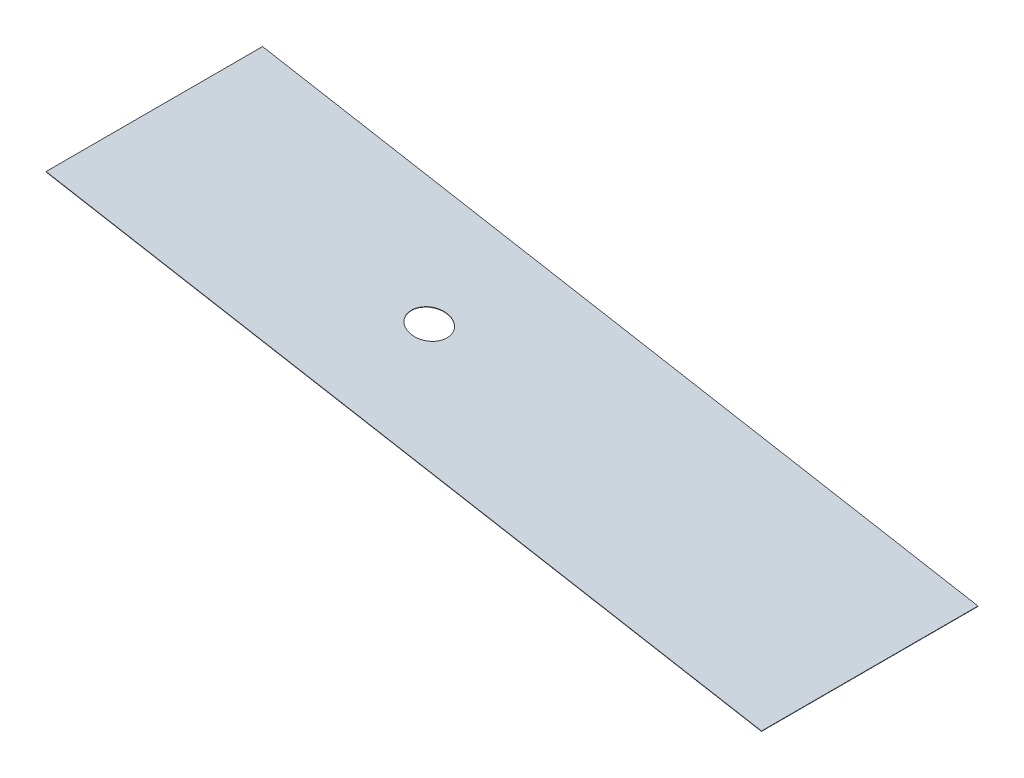
ISO-10303-21;
HEADER;
FILE_DESCRIPTION(('STEP AP214'),'2;1');
FILE_NAME('part.step','',(''),(''),'','','');
FILE_SCHEMA(('AUTOMOTIVE_DESIGN { 1 0 10303 214 1 1 1 1 }'));
ENDSEC;
DATA;
#1=APPLICATION_CONTEXT('core data for automotive mechanical design processes');
#2=APPLICATION_PROTOCOL_DEFINITION('international standard','automotive_design',2000,#1);
#3=PRODUCT_CONTEXT('',#1,'mechanical');
#4=PRODUCT('Part','Part','',(#3));
#5=PRODUCT_RELATED_PRODUCT_CATEGORY('part','',(#4));
#6=PRODUCT_DEFINITION_FORMATION('','',#4);
#7=PRODUCT_DEFINITION_CONTEXT('part definition',#1,'design');
#8=PRODUCT_DEFINITION('design','',#6,#7);
#9=PRODUCT_DEFINITION_SHAPE('','',#8);
#10=(LENGTH_UNIT() NAMED_UNIT(*) SI_UNIT(.MILLI.,.METRE.));
#11=(NAMED_UNIT(*) PLANE_ANGLE_UNIT() SI_UNIT($,.RADIAN.));
#12=(NAMED_UNIT(*) SI_UNIT($,.STERADIAN.) SOLID_ANGLE_UNIT());
#13=UNCERTAINTY_MEASURE_WITH_UNIT(LENGTH_MEASURE(1.E-05),#10,'distance_accuracy_value','');
#14=(GEOMETRIC_REPRESENTATION_CONTEXT(3) GLOBAL_UNCERTAINTY_ASSIGNED_CONTEXT((#13)) GLOBAL_UNIT_ASSIGNED_CONTEXT((#10,
#11,#12)) REPRESENTATION_CONTEXT('',''));
#15=CARTESIAN_POINT('',(0.,0.,0.));
#16=DIRECTION('',(0.,0.,1.));
#17=DIRECTION('',(1.,0.,0.));
#18=AXIS2_PLACEMENT_3D('',#15,#16,#17);
#19=CARTESIAN_POINT('',(139.867775939067,789.201656900097,1.21163856052703E-12));
#20=DIRECTION('',(0.984655841422455,-0.174507518326972,0.));
#21=DIRECTION('',(0.,0.,1.));
#22=AXIS2_PLACEMENT_3D('',#19,#20,#21);
#23=PLANE('',#22);
#24=DIRECTION('',(-0.174507518326972,-0.984655841422454,0.));
#25=VECTOR('',#24,1.);
#26=CARTESIAN_POINT('',(139.867775939067,789.201656900097,750.000000000002));
#27=LINE('',#26,#25);
#28=CARTESIAN_POINT('',(140.129537216556,790.678640662231,750.000000000002));
#29=VERTEX_POINT('',#28);
#30=CARTESIAN_POINT('',(139.606014661575,787.724673137964,750.000000000002));
#31=VERTEX_POINT('',#30);
#32=EDGE_CURVE('E12',#29,#31,#27,.T.);
#33=ORIENTED_EDGE('',*,*,#32,.F.);
#34=DIRECTION('',(0.,0.,1.));
#35=VECTOR('',#34,1.);
#36=CARTESIAN_POINT('',(140.129537216556,790.678640662231,1.21163856052703E-12));
#37=LINE('',#36,#35);
#38=CARTESIAN_POINT('',(140.129537216556,790.678640662231,-750.));
#39=VERTEX_POINT('',#38);
#40=EDGE_CURVE('E85',#29,#39,#37,.F.);
#41=ORIENTED_EDGE('',*,*,#40,.T.);
#42=DIRECTION('',(-0.174507518326972,-0.984655841422454,0.));
#43=VECTOR('',#42,1.);
#44=CARTESIAN_POINT('',(139.867775939067,789.201656900097,-750.));
#45=LINE('',#44,#43);
#46=CARTESIAN_POINT('',(139.606014661575,787.724673137964,-750.));
#47=VERTEX_POINT('',#46);
#48=EDGE_CURVE('E57',#39,#47,#45,.T.);
#49=ORIENTED_EDGE('',*,*,#48,.T.);
#50=DIRECTION('',(0.,0.,1.));
#51=VECTOR('',#50,1.);
#52=CARTESIAN_POINT('',(139.606014661575,787.724673137964,1.21163856052703E-12));
#53=LINE('',#52,#51);
#54=EDGE_CURVE('E87',#31,#47,#53,.F.);
#55=ORIENTED_EDGE('',*,*,#54,.F.);
#56=EDGE_LOOP('',(#33,#41,#49,#55));
#57=FACE_BOUND('',#56,.T.);
#58=ADVANCED_FACE('F47',(#57),#23,.F.);
#59=CARTESIAN_POINT('',(2618.52919508856,349.916137196354,-750.));
#60=DIRECTION('',(0.,0.,-1.));
#61=DIRECTION('',(0.984655841422455,-0.174507518326972,0.));
#62=AXIS2_PLACEMENT_3D('',#59,#60,#61);
#63=PLANE('',#62);
#64=ORIENTED_EDGE('',*,*,#48,.F.);
#65=DIRECTION('',(0.984655841422455,-0.174507518326972,0.));
#66=VECTOR('',#65,1.);
#67=CARTESIAN_POINT('',(2618.79095636605,351.393120958488,-750.));
#68=LINE('',#67,#66);
#69=CARTESIAN_POINT('',(5097.45237551555,-87.8923987452567,-750.));
#70=VERTEX_POINT('',#69);
#71=EDGE_CURVE('E100',#39,#70,#68,.T.);
#72=ORIENTED_EDGE('',*,*,#71,.T.);
#73=DIRECTION('',(-0.174507518326972,-0.984655841422454,0.));
#74=VECTOR('',#73,1.);
#75=CARTESIAN_POINT('',(5097.19061423806,-89.3693825073901,-750.));
#76=LINE('',#75,#74);
#77=CARTESIAN_POINT('',(5096.92885296057,-90.846366269524,-750.));
#78=VERTEX_POINT('',#77);
#79=EDGE_CURVE('E111',#70,#78,#76,.T.);
#80=ORIENTED_EDGE('',*,*,#79,.T.);
#81=DIRECTION('',(0.984655841422455,-0.174507518326972,0.));
#82=VECTOR('',#81,1.);
#83=CARTESIAN_POINT('',(2618.26743381107,348.439153434221,-750.));
#84=LINE('',#83,#82);
#85=EDGE_CURVE('E119',#47,#78,#84,.T.);
#86=ORIENTED_EDGE('',*,*,#85,.F.);
#87=EDGE_LOOP('',(#64,#72,#80,#86));
#88=FACE_BOUND('',#87,.T.);
#89=ADVANCED_FACE('F122',(#88),#63,.T.);
#90=CARTESIAN_POINT('',(5097.19061423806,-89.36938250739,1.21163856052703E-12));
#91=DIRECTION('',(0.984655841422455,-0.174507518326972,0.));
#92=DIRECTION('',(0.,0.,1.));
#93=AXIS2_PLACEMENT_3D('',#90,#91,#92);
#94=PLANE('',#93);
#95=ORIENTED_EDGE('',*,*,#79,.F.);
#96=DIRECTION('',(0.,0.,1.));
#97=VECTOR('',#96,1.);
#98=CARTESIAN_POINT('',(5097.45237551555,-87.8923987452567,1.21163856052703E-12));
#99=LINE('',#98,#97);
#100=CARTESIAN_POINT('',(5097.45237551555,-87.8923987452567,750.000000000002));
#101=VERTEX_POINT('',#100);
#102=EDGE_CURVE('E104',#70,#101,#99,.T.);
#103=ORIENTED_EDGE('',*,*,#102,.T.);
#104=DIRECTION('',(-0.174507518326972,-0.984655841422454,0.));
#105=VECTOR('',#104,1.);
#106=CARTESIAN_POINT('',(5097.19061423806,-89.3693825073902,750.000000000002));
#107=LINE('',#106,#105);
#108=CARTESIAN_POINT('',(5096.92885296057,-90.846366269524,750.000000000002));
#109=VERTEX_POINT('',#108);
#110=EDGE_CURVE('E51',#101,#109,#107,.T.);
#111=ORIENTED_EDGE('',*,*,#110,.T.);
#112=DIRECTION('',(0.,0.,1.));
#113=VECTOR('',#112,1.);
#114=CARTESIAN_POINT('',(5096.92885296057,-90.846366269524,1.21163856052703E-12));
#115=LINE('',#114,#113);
#116=EDGE_CURVE('E123',#78,#109,#115,.T.);
#117=ORIENTED_EDGE('',*,*,#116,.F.);
#118=EDGE_LOOP('',(#95,#103,#111,#117));
#119=FACE_BOUND('',#118,.T.);
#120=ADVANCED_FACE('F149',(#119),#94,.T.);
#121=CARTESIAN_POINT('',(2618.52919508856,349.916137196354,750.000000000002));
#122=DIRECTION('',(0.,0.,-1.));
#123=DIRECTION('',(0.984655841422455,-0.174507518326972,0.));
#124=AXIS2_PLACEMENT_3D('',#121,#122,#123);
#125=PLANE('',#124);
#126=DIRECTION('',(0.984655841422455,-0.174507518326972,0.));
#127=VECTOR('',#126,1.);
#128=CARTESIAN_POINT('',(2618.79095636605,351.393120958488,750.000000000002));
#129=LINE('',#128,#127);
#130=EDGE_CURVE('E98',#101,#29,#129,.F.);
#131=ORIENTED_EDGE('',*,*,#130,.T.);
#132=ORIENTED_EDGE('',*,*,#32,.T.);
#133=DIRECTION('',(0.984655841422455,-0.174507518326972,0.));
#134=VECTOR('',#133,1.);
#135=CARTESIAN_POINT('',(2618.26743381107,348.439153434221,750.000000000002));
#136=LINE('',#135,#134);
#137=EDGE_CURVE('E120',#109,#31,#136,.F.);
#138=ORIENTED_EDGE('',*,*,#137,.F.);
#139=ORIENTED_EDGE('',*,*,#110,.F.);
#140=EDGE_LOOP('',(#131,#132,#138,#139));
#141=FACE_BOUND('',#140,.T.);
#142=ADVANCED_FACE('F102',(#141),#125,.F.);
#143=CARTESIAN_POINT('',(2044.75750582844,451.603924306226,5.55111512312578E-13));
#144=DIRECTION('',(0.174507518326972,0.984655841422455,0.));
#145=DIRECTION('',(-0.984655841422455,0.174507518326972,0.));
#146=AXIS2_PLACEMENT_3D('',#143,#144,#145);
#147=CYLINDRICAL_SURFACE('',#146,125.);
#148=CARTESIAN_POINT('',(2044.49574455095,450.126940544092,5.55111512312578E-13));
#149=DIRECTION('',(0.174507518326972,0.984655841422455,0.));
#150=DIRECTION('',(-0.984655841422455,0.174507518326972,0.));
#151=AXIS2_PLACEMENT_3D('',#148,#149,#150);
#152=CIRCLE('',#151,125.);
#153=CARTESIAN_POINT('',(1921.41376437314,471.940380334964,5.55111512312578E-13));
#154=VERTEX_POINT('',#153);
#155=EDGE_CURVE('E128',#154,#154,#152,.T.);
#156=ORIENTED_EDGE('',*,*,#155,.F.);
#157=EDGE_LOOP('',(#156));
#158=FACE_BOUND('',#157,.T.);
#159=CARTESIAN_POINT('',(2045.01926710593,453.08090806836,5.55111512312578E-13));
#160=DIRECTION('',(0.174507518326972,0.984655841422455,0.));
#161=DIRECTION('',(-0.984655841422455,0.174507518326972,0.));
#162=AXIS2_PLACEMENT_3D('',#159,#160,#161);
#163=CIRCLE('',#162,125.);
#164=CARTESIAN_POINT('',(1921.93728692812,474.894347859231,5.55111512312578E-13));
#165=VERTEX_POINT('',#164);
#166=EDGE_CURVE('E103',#165,#165,#163,.T.);
#167=ORIENTED_EDGE('',*,*,#166,.T.);
#168=EDGE_LOOP('',(#167));
#169=FACE_BOUND('',#168,.T.);
#170=ADVANCED_FACE('F49',(#158,#169),#147,.F.);
#171=CARTESIAN_POINT('',(2618.26743381107,348.439153434221,1.21163856052703E-12));
#172=DIRECTION('',(-0.174507518326972,-0.984655841422454,0.));
#173=DIRECTION('',(0.984655841422455,-0.174507518326972,0.));
#174=AXIS2_PLACEMENT_3D('',#171,#172,#173);
#175=PLANE('',#174);
#176=ORIENTED_EDGE('',*,*,#116,.T.);
#177=ORIENTED_EDGE('',*,*,#137,.T.);
#178=ORIENTED_EDGE('',*,*,#54,.T.);
#179=ORIENTED_EDGE('',*,*,#85,.T.);
#180=EDGE_LOOP('',(#176,#177,#178,#179));
#181=FACE_BOUND('',#180,.T.);
#182=ORIENTED_EDGE('',*,*,#155,.T.);
#183=EDGE_LOOP('',(#182));
#184=FACE_BOUND('',#183,.T.);
#185=ADVANCED_FACE('F117',(#181,#184),#175,.T.);
#186=CARTESIAN_POINT('',(2618.79095636605,351.393120958488,1.21163856052703E-12));
#187=DIRECTION('',(-0.174507518326972,-0.984655841422454,0.));
#188=DIRECTION('',(0.984655841422455,-0.174507518326972,0.));
#189=AXIS2_PLACEMENT_3D('',#186,#187,#188);
#190=PLANE('',#189);
#191=ORIENTED_EDGE('',*,*,#102,.F.);
#192=ORIENTED_EDGE('',*,*,#71,.F.);
#193=ORIENTED_EDGE('',*,*,#40,.F.);
#194=ORIENTED_EDGE('',*,*,#130,.F.);
#195=EDGE_LOOP('',(#191,#192,#193,#194));
#196=FACE_BOUND('',#195,.T.);
#197=ORIENTED_EDGE('',*,*,#166,.F.);
#198=EDGE_LOOP('',(#197));
#199=FACE_BOUND('',#198,.T.);
#200=ADVANCED_FACE('F96',(#196,#199),#190,.F.);
#201=CLOSED_SHELL('',(#58,#89,#120,#142,#170,#185,#200));
#202=MANIFOLD_SOLID_BREP('B2',#201);
#203=ADVANCED_BREP_SHAPE_REPRESENTATION('',(#18,#202),#14);
#204=SHAPE_DEFINITION_REPRESENTATION(#9,#203);
ENDSEC;
END-ISO-10303-21;
